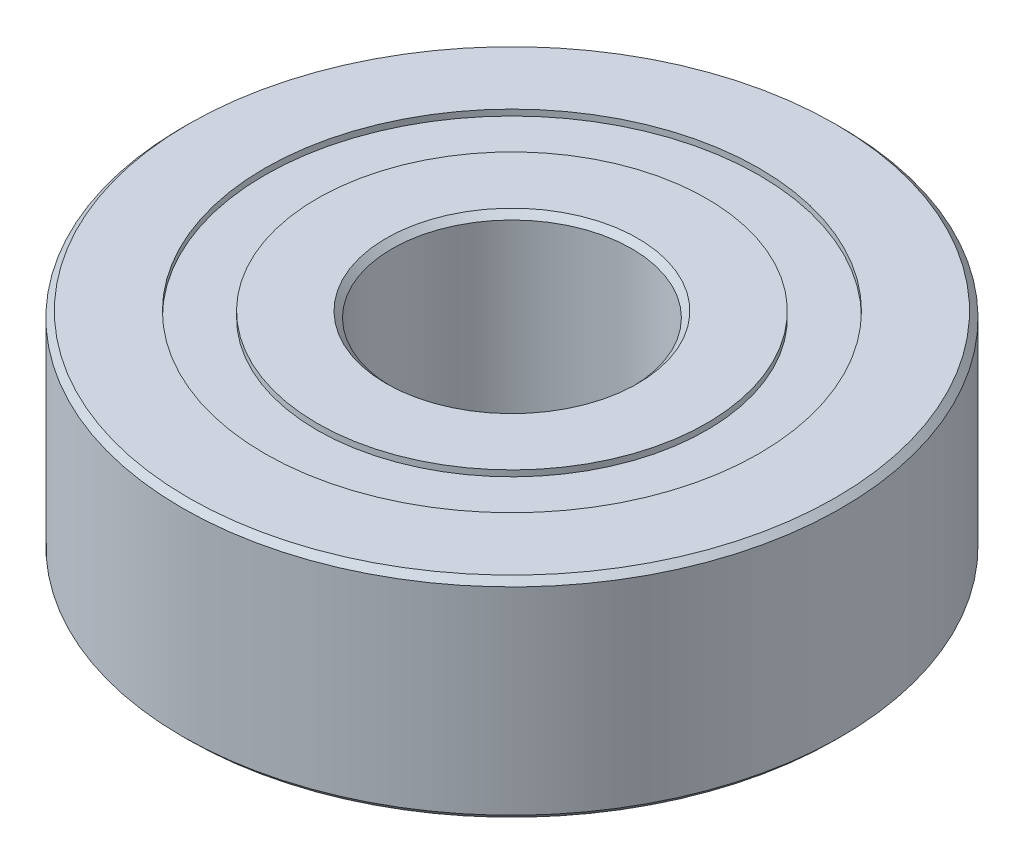
ISO-10303-21;
HEADER;
FILE_DESCRIPTION(('STEP AP214'),'2;1');
FILE_NAME('part.step','',(''),(''),'','','');
FILE_SCHEMA(('AUTOMOTIVE_DESIGN { 1 0 10303 214 1 1 1 1 }'));
ENDSEC;
DATA;
#1=APPLICATION_CONTEXT('core data for automotive mechanical design processes');
#2=APPLICATION_PROTOCOL_DEFINITION('international standard','automotive_design',2000,#1);
#3=PRODUCT_CONTEXT('',#1,'mechanical');
#4=PRODUCT('Part','Part','',(#3));
#5=PRODUCT_RELATED_PRODUCT_CATEGORY('part','',(#4));
#6=PRODUCT_DEFINITION_FORMATION('','',#4);
#7=PRODUCT_DEFINITION_CONTEXT('part definition',#1,'design');
#8=PRODUCT_DEFINITION('design','',#6,#7);
#9=PRODUCT_DEFINITION_SHAPE('','',#8);
#10=(LENGTH_UNIT() NAMED_UNIT(*) SI_UNIT(.MILLI.,.METRE.));
#11=(NAMED_UNIT(*) PLANE_ANGLE_UNIT() SI_UNIT($,.RADIAN.));
#12=(NAMED_UNIT(*) SI_UNIT($,.STERADIAN.) SOLID_ANGLE_UNIT());
#13=UNCERTAINTY_MEASURE_WITH_UNIT(LENGTH_MEASURE(1.E-05),#10,'distance_accuracy_value','');
#14=(GEOMETRIC_REPRESENTATION_CONTEXT(3) GLOBAL_UNCERTAINTY_ASSIGNED_CONTEXT((#13)) GLOBAL_UNIT_ASSIGNED_CONTEXT((#10,
#11,#12)) REPRESENTATION_CONTEXT('',''));
#15=CARTESIAN_POINT('',(0.,0.,0.));
#16=DIRECTION('',(0.,0.,1.));
#17=DIRECTION('',(1.,0.,0.));
#18=AXIS2_PLACEMENT_3D('',#15,#16,#17);
#19=CARTESIAN_POINT('',(0.,0.,0.));
#20=DIRECTION('',(0.,1.,0.));
#21=DIRECTION('',(0.,0.,1.));
#22=AXIS2_PLACEMENT_3D('',#19,#20,#21);
#23=PLANE('',#22);
#24=CARTESIAN_POINT('',(0.,0.,0.));
#25=DIRECTION('',(0.,1.,0.));
#26=DIRECTION('',(0.,0.,1.));
#27=AXIS2_PLACEMENT_3D('',#24,#25,#26);
#28=CIRCLE('',#27,4.2);
#29=CARTESIAN_POINT('',(0.,0.,4.2));
#30=VERTEX_POINT('',#29);
#31=EDGE_CURVE('E10',#30,#30,#28,.T.);
#32=ORIENTED_EDGE('',*,*,#31,.T.);
#33=EDGE_LOOP('',(#32));
#34=FACE_BOUND('',#33,.T.);
#35=CARTESIAN_POINT('',(0.,0.,0.));
#36=DIRECTION('',(0.,-1.,0.));
#37=DIRECTION('',(0.,0.,-1.));
#38=AXIS2_PLACEMENT_3D('',#35,#36,#37);
#39=CIRCLE('',#38,6.5);
#40=CARTESIAN_POINT('',(0.,0.,-6.5));
#41=VERTEX_POINT('',#40);
#42=EDGE_CURVE('E86',#41,#41,#39,.T.);
#43=ORIENTED_EDGE('',*,*,#42,.T.);
#44=EDGE_LOOP('',(#43));
#45=FACE_BOUND('',#44,.T.);
#46=ADVANCED_FACE('F34',(#34,#45),#23,.F.);
#47=CARTESIAN_POINT('',(0.,7.,0.));
#48=DIRECTION('',(0.,1.,0.));
#49=DIRECTION('',(0.,0.,1.));
#50=AXIS2_PLACEMENT_3D('',#47,#48,#49);
#51=PLANE('',#50);
#52=CARTESIAN_POINT('',(0.,7.,0.));
#53=DIRECTION('',(0.,1.,0.));
#54=DIRECTION('',(0.,0.,1.));
#55=AXIS2_PLACEMENT_3D('',#52,#53,#54);
#56=CIRCLE('',#55,4.2);
#57=CARTESIAN_POINT('',(0.,7.,4.2));
#58=VERTEX_POINT('',#57);
#59=EDGE_CURVE('E42',#58,#58,#56,.F.);
#60=ORIENTED_EDGE('',*,*,#59,.T.);
#61=EDGE_LOOP('',(#60));
#62=FACE_BOUND('',#61,.T.);
#63=CARTESIAN_POINT('',(0.,7.,0.));
#64=DIRECTION('',(0.,1.,0.));
#65=DIRECTION('',(0.,0.,1.));
#66=AXIS2_PLACEMENT_3D('',#63,#64,#65);
#67=CIRCLE('',#66,6.5);
#68=CARTESIAN_POINT('',(0.,7.,6.5));
#69=VERTEX_POINT('',#68);
#70=EDGE_CURVE('E74',#69,#69,#67,.T.);
#71=ORIENTED_EDGE('',*,*,#70,.T.);
#72=EDGE_LOOP('',(#71));
#73=FACE_BOUND('',#72,.T.);
#74=ADVANCED_FACE('F121',(#62,#73),#51,.T.);
#75=CARTESIAN_POINT('',(0.,7.,0.));
#76=DIRECTION('',(0.,1.,0.));
#77=DIRECTION('',(0.,0.,1.));
#78=AXIS2_PLACEMENT_3D('',#75,#76,#77);
#79=CIRCLE('',#78,10.8);
#80=CARTESIAN_POINT('',(0.,7.,10.8));
#81=VERTEX_POINT('',#80);
#82=EDGE_CURVE('E64',#81,#81,#79,.T.);
#83=ORIENTED_EDGE('',*,*,#82,.T.);
#84=EDGE_LOOP('',(#83));
#85=FACE_BOUND('',#84,.T.);
#86=CARTESIAN_POINT('',(0.,7.,0.));
#87=DIRECTION('',(0.,1.,0.));
#88=DIRECTION('',(0.,0.,1.));
#89=AXIS2_PLACEMENT_3D('',#86,#87,#88);
#90=CIRCLE('',#89,8.25);
#91=CARTESIAN_POINT('',(0.,7.,8.25));
#92=VERTEX_POINT('',#91);
#93=EDGE_CURVE('E68',#92,#92,#90,.T.);
#94=ORIENTED_EDGE('',*,*,#93,.F.);
#95=EDGE_LOOP('',(#94));
#96=FACE_BOUND('',#95,.T.);
#97=ADVANCED_FACE('F111',(#85,#96),#51,.T.);
#98=CARTESIAN_POINT('',(0.,0.,0.));
#99=DIRECTION('',(0.,1.,0.));
#100=DIRECTION('',(0.,0.,1.));
#101=AXIS2_PLACEMENT_3D('',#98,#99,#100);
#102=CIRCLE('',#101,10.8);
#103=CARTESIAN_POINT('',(0.,0.,10.8));
#104=VERTEX_POINT('',#103);
#105=EDGE_CURVE('E55',#104,#104,#102,.F.);
#106=ORIENTED_EDGE('',*,*,#105,.T.);
#107=EDGE_LOOP('',(#106));
#108=FACE_BOUND('',#107,.T.);
#109=CARTESIAN_POINT('',(0.,0.,0.));
#110=DIRECTION('',(0.,-1.,0.));
#111=DIRECTION('',(0.,0.,-1.));
#112=AXIS2_PLACEMENT_3D('',#109,#110,#111);
#113=CIRCLE('',#112,8.25);
#114=CARTESIAN_POINT('',(0.,0.,-8.25));
#115=VERTEX_POINT('',#114);
#116=EDGE_CURVE('E80',#115,#115,#113,.T.);
#117=ORIENTED_EDGE('',*,*,#116,.F.);
#118=EDGE_LOOP('',(#117));
#119=FACE_BOUND('',#118,.T.);
#120=ADVANCED_FACE('F108',(#108,#119),#23,.F.);
#121=CARTESIAN_POINT('',(0.,7.,0.));
#122=DIRECTION('',(0.,-1.,0.));
#123=DIRECTION('',(0.,0.,-1.));
#124=AXIS2_PLACEMENT_3D('',#121,#122,#123);
#125=CYLINDRICAL_SURFACE('',#124,11.);
#126=CARTESIAN_POINT('',(0.,6.80000000000001,0.));
#127=DIRECTION('',(0.,1.,0.));
#128=DIRECTION('',(0.,0.,1.));
#129=AXIS2_PLACEMENT_3D('',#126,#127,#128);
#130=CIRCLE('',#129,11.);
#131=CARTESIAN_POINT('',(0.,6.80000000000001,11.));
#132=VERTEX_POINT('',#131);
#133=EDGE_CURVE('E58',#132,#132,#130,.F.);
#134=ORIENTED_EDGE('',*,*,#133,.T.);
#135=EDGE_LOOP('',(#134));
#136=FACE_BOUND('',#135,.T.);
#137=CARTESIAN_POINT('',(0.,0.199999999999999,0.));
#138=DIRECTION('',(0.,1.,0.));
#139=DIRECTION('',(0.,0.,1.));
#140=AXIS2_PLACEMENT_3D('',#137,#138,#139);
#141=CIRCLE('',#140,11.);
#142=CARTESIAN_POINT('',(0.,0.199999999999999,11.));
#143=VERTEX_POINT('',#142);
#144=EDGE_CURVE('E61',#143,#143,#141,.T.);
#145=ORIENTED_EDGE('',*,*,#144,.T.);
#146=EDGE_LOOP('',(#145));
#147=FACE_BOUND('',#146,.T.);
#148=ADVANCED_FACE('F110',(#136,#147),#125,.T.);
#149=CARTESIAN_POINT('',(0.,7.,0.));
#150=DIRECTION('',(0.,-1.,0.));
#151=DIRECTION('',(0.,0.,-1.));
#152=AXIS2_PLACEMENT_3D('',#149,#150,#151);
#153=CYLINDRICAL_SURFACE('',#152,4.);
#154=CARTESIAN_POINT('',(0.,6.8,0.));
#155=DIRECTION('',(0.,1.,0.));
#156=DIRECTION('',(0.,0.,1.));
#157=AXIS2_PLACEMENT_3D('',#154,#155,#156);
#158=CIRCLE('',#157,4.);
#159=CARTESIAN_POINT('',(0.,6.8,4.));
#160=VERTEX_POINT('',#159);
#161=EDGE_CURVE('E46',#160,#160,#158,.T.);
#162=ORIENTED_EDGE('',*,*,#161,.T.);
#163=EDGE_LOOP('',(#162));
#164=FACE_BOUND('',#163,.T.);
#165=CARTESIAN_POINT('',(0.,0.200000000000002,0.));
#166=DIRECTION('',(0.,1.,0.));
#167=DIRECTION('',(0.,0.,1.));
#168=AXIS2_PLACEMENT_3D('',#165,#166,#167);
#169=CIRCLE('',#168,4.);
#170=CARTESIAN_POINT('',(0.,0.200000000000002,4.));
#171=VERTEX_POINT('',#170);
#172=EDGE_CURVE('E50',#171,#171,#169,.F.);
#173=ORIENTED_EDGE('',*,*,#172,.T.);
#174=EDGE_LOOP('',(#173));
#175=FACE_BOUND('',#174,.T.);
#176=ADVANCED_FACE('F118',(#164,#175),#153,.F.);
#177=CARTESIAN_POINT('',(0.,6.8,0.));
#178=DIRECTION('',(0.,1.,0.));
#179=DIRECTION('',(0.,0.,1.));
#180=AXIS2_PLACEMENT_3D('',#177,#178,#179);
#181=CYLINDRICAL_SURFACE('',#180,8.25);
#182=CARTESIAN_POINT('',(0.,6.8,0.));
#183=DIRECTION('',(0.,1.,0.));
#184=DIRECTION('',(0.,0.,1.));
#185=AXIS2_PLACEMENT_3D('',#182,#183,#184);
#186=CIRCLE('',#185,8.25);
#187=CARTESIAN_POINT('',(0.,6.8,8.25));
#188=VERTEX_POINT('',#187);
#189=EDGE_CURVE('E67',#188,#188,#186,.T.);
#190=ORIENTED_EDGE('',*,*,#189,.F.);
#191=EDGE_LOOP('',(#190));
#192=FACE_BOUND('',#191,.T.);
#193=ORIENTED_EDGE('',*,*,#93,.T.);
#194=EDGE_LOOP('',(#193));
#195=FACE_BOUND('',#194,.T.);
#196=ADVANCED_FACE('F146',(#192,#195),#181,.F.);
#197=CARTESIAN_POINT('',(0.,6.8,0.));
#198=DIRECTION('',(0.,1.,0.));
#199=DIRECTION('',(0.,0.,1.));
#200=AXIS2_PLACEMENT_3D('',#197,#198,#199);
#201=PLANE('',#200);
#202=CARTESIAN_POINT('',(0.,6.8,0.));
#203=DIRECTION('',(0.,1.,0.));
#204=DIRECTION('',(0.,0.,1.));
#205=AXIS2_PLACEMENT_3D('',#202,#203,#204);
#206=CIRCLE('',#205,6.5);
#207=CARTESIAN_POINT('',(0.,6.8,6.5));
#208=VERTEX_POINT('',#207);
#209=EDGE_CURVE('E71',#208,#208,#206,.T.);
#210=ORIENTED_EDGE('',*,*,#209,.F.);
#211=EDGE_LOOP('',(#210));
#212=FACE_BOUND('',#211,.T.);
#213=ORIENTED_EDGE('',*,*,#189,.T.);
#214=EDGE_LOOP('',(#213));
#215=FACE_BOUND('',#214,.T.);
#216=ADVANCED_FACE('F142',(#212,#215),#201,.T.);
#217=CARTESIAN_POINT('',(0.,6.8,0.));
#218=DIRECTION('',(0.,1.,0.));
#219=DIRECTION('',(0.,0.,1.));
#220=AXIS2_PLACEMENT_3D('',#217,#218,#219);
#221=CYLINDRICAL_SURFACE('',#220,6.5);
#222=ORIENTED_EDGE('',*,*,#209,.T.);
#223=EDGE_LOOP('',(#222));
#224=FACE_BOUND('',#223,.T.);
#225=ORIENTED_EDGE('',*,*,#70,.F.);
#226=EDGE_LOOP('',(#225));
#227=FACE_BOUND('',#226,.T.);
#228=ADVANCED_FACE('F104',(#224,#227),#221,.T.);
#229=CARTESIAN_POINT('',(0.,0.2,0.));
#230=DIRECTION('',(0.,-1.,0.));
#231=DIRECTION('',(0.,0.,-1.));
#232=AXIS2_PLACEMENT_3D('',#229,#230,#231);
#233=CYLINDRICAL_SURFACE('',#232,8.25);
#234=CARTESIAN_POINT('',(0.,0.2,0.));
#235=DIRECTION('',(0.,-1.,0.));
#236=DIRECTION('',(0.,0.,-1.));
#237=AXIS2_PLACEMENT_3D('',#234,#235,#236);
#238=CIRCLE('',#237,8.25);
#239=CARTESIAN_POINT('',(0.,0.2,-8.25));
#240=VERTEX_POINT('',#239);
#241=EDGE_CURVE('E77',#240,#240,#238,.T.);
#242=ORIENTED_EDGE('',*,*,#241,.F.);
#243=EDGE_LOOP('',(#242));
#244=FACE_BOUND('',#243,.T.);
#245=ORIENTED_EDGE('',*,*,#116,.T.);
#246=EDGE_LOOP('',(#245));
#247=FACE_BOUND('',#246,.T.);
#248=ADVANCED_FACE('F98',(#244,#247),#233,.F.);
#249=CARTESIAN_POINT('',(0.,0.2,0.));
#250=DIRECTION('',(0.,-1.,0.));
#251=DIRECTION('',(0.,0.,-1.));
#252=AXIS2_PLACEMENT_3D('',#249,#250,#251);
#253=PLANE('',#252);
#254=CARTESIAN_POINT('',(0.,0.2,0.));
#255=DIRECTION('',(0.,-1.,0.));
#256=DIRECTION('',(0.,0.,-1.));
#257=AXIS2_PLACEMENT_3D('',#254,#255,#256);
#258=CIRCLE('',#257,6.5);
#259=CARTESIAN_POINT('',(0.,0.2,-6.5));
#260=VERTEX_POINT('',#259);
#261=EDGE_CURVE('E83',#260,#260,#258,.T.);
#262=ORIENTED_EDGE('',*,*,#261,.F.);
#263=EDGE_LOOP('',(#262));
#264=FACE_BOUND('',#263,.T.);
#265=ORIENTED_EDGE('',*,*,#241,.T.);
#266=EDGE_LOOP('',(#265));
#267=FACE_BOUND('',#266,.T.);
#268=ADVANCED_FACE('F95',(#264,#267),#253,.T.);
#269=CARTESIAN_POINT('',(0.,0.2,0.));
#270=DIRECTION('',(0.,-1.,0.));
#271=DIRECTION('',(0.,0.,-1.));
#272=AXIS2_PLACEMENT_3D('',#269,#270,#271);
#273=CYLINDRICAL_SURFACE('',#272,6.5);
#274=ORIENTED_EDGE('',*,*,#261,.T.);
#275=EDGE_LOOP('',(#274));
#276=FACE_BOUND('',#275,.T.);
#277=ORIENTED_EDGE('',*,*,#42,.F.);
#278=EDGE_LOOP('',(#277));
#279=FACE_BOUND('',#278,.T.);
#280=ADVANCED_FACE('F92',(#276,#279),#273,.T.);
#281=CARTESIAN_POINT('',(0.,7.,0.));
#282=DIRECTION('',(0.,-1.,0.));
#283=DIRECTION('',(0.,0.,-1.));
#284=AXIS2_PLACEMENT_3D('',#281,#282,#283);
#285=CONICAL_SURFACE('',#284,10.8,0.785398163397448);
#286=ORIENTED_EDGE('',*,*,#133,.F.);
#287=EDGE_LOOP('',(#286));
#288=FACE_BOUND('',#287,.T.);
#289=ORIENTED_EDGE('',*,*,#82,.F.);
#290=EDGE_LOOP('',(#289));
#291=FACE_BOUND('',#290,.T.);
#292=ADVANCED_FACE('F131',(#288,#291),#285,.T.);
#293=CARTESIAN_POINT('',(0.,0.199999999999999,0.));
#294=DIRECTION('',(0.,1.,0.));
#295=DIRECTION('',(0.,0.,1.));
#296=AXIS2_PLACEMENT_3D('',#293,#294,#295);
#297=CONICAL_SURFACE('',#296,11.,0.785398163397453);
#298=ORIENTED_EDGE('',*,*,#105,.F.);
#299=EDGE_LOOP('',(#298));
#300=FACE_BOUND('',#299,.T.);
#301=ORIENTED_EDGE('',*,*,#144,.F.);
#302=EDGE_LOOP('',(#301));
#303=FACE_BOUND('',#302,.T.);
#304=ADVANCED_FACE('F136',(#300,#303),#297,.T.);
#305=CARTESIAN_POINT('',(0.,6.8,0.));
#306=DIRECTION('',(0.,1.,0.));
#307=DIRECTION('',(0.,0.,1.));
#308=AXIS2_PLACEMENT_3D('',#305,#306,#307);
#309=CONICAL_SURFACE('',#308,4.,0.785398163397455);
#310=ORIENTED_EDGE('',*,*,#59,.F.);
#311=EDGE_LOOP('',(#310));
#312=FACE_BOUND('',#311,.T.);
#313=ORIENTED_EDGE('',*,*,#161,.F.);
#314=EDGE_LOOP('',(#313));
#315=FACE_BOUND('',#314,.T.);
#316=ADVANCED_FACE('F161',(#312,#315),#309,.F.);
#317=CARTESIAN_POINT('',(0.,0.,0.));
#318=DIRECTION('',(0.,-1.,0.));
#319=DIRECTION('',(0.,0.,-1.));
#320=AXIS2_PLACEMENT_3D('',#317,#318,#319);
#321=CONICAL_SURFACE('',#320,4.2,0.78539816339744);
#322=ORIENTED_EDGE('',*,*,#172,.F.);
#323=EDGE_LOOP('',(#322));
#324=FACE_BOUND('',#323,.T.);
#325=ORIENTED_EDGE('',*,*,#31,.F.);
#326=EDGE_LOOP('',(#325));
#327=FACE_BOUND('',#326,.T.);
#328=ADVANCED_FACE('F37',(#324,#327),#321,.F.);
#329=CLOSED_SHELL('',(#46,#74,#97,#120,#148,#176,#196,#216,#228,#248,#268,#280,#292,#304,#316,#328));
#330=MANIFOLD_SOLID_BREP('B2',#329);
#331=ADVANCED_BREP_SHAPE_REPRESENTATION('',(#18,#330),#14);
#332=SHAPE_DEFINITION_REPRESENTATION(#9,#331);
ENDSEC;
END-ISO-10303-21;
